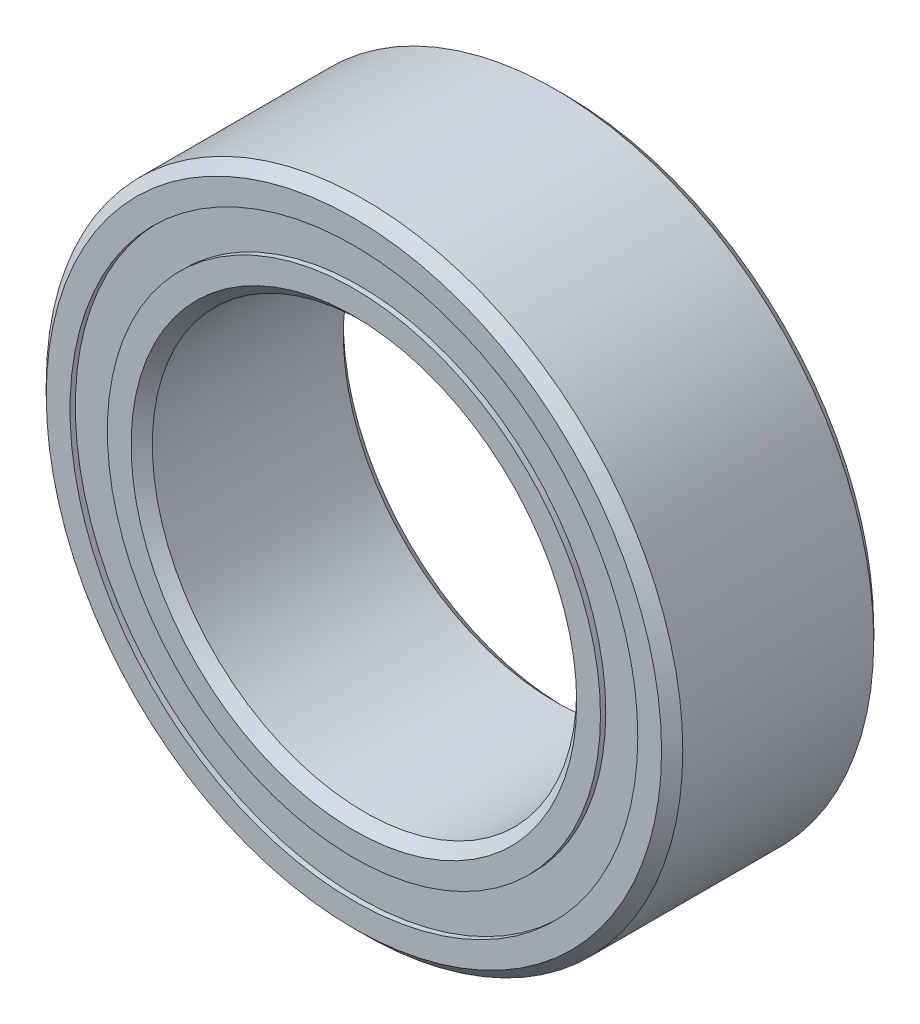
ISO-10303-21;
HEADER;
FILE_DESCRIPTION(('STEP AP214'),'2;1');
FILE_NAME('part.step','',(''),(''),'','','');
FILE_SCHEMA(('AUTOMOTIVE_DESIGN { 1 0 10303 214 1 1 1 1 }'));
ENDSEC;
DATA;
#1=APPLICATION_CONTEXT('core data for automotive mechanical design processes');
#2=APPLICATION_PROTOCOL_DEFINITION('international standard','automotive_design',2000,#1);
#3=PRODUCT_CONTEXT('',#1,'mechanical');
#4=PRODUCT('Part','Part','',(#3));
#5=PRODUCT_RELATED_PRODUCT_CATEGORY('part','',(#4));
#6=PRODUCT_DEFINITION_FORMATION('','',#4);
#7=PRODUCT_DEFINITION_CONTEXT('part definition',#1,'design');
#8=PRODUCT_DEFINITION('design','',#6,#7);
#9=PRODUCT_DEFINITION_SHAPE('','',#8);
#10=(LENGTH_UNIT() NAMED_UNIT(*) SI_UNIT(.MILLI.,.METRE.));
#11=(NAMED_UNIT(*) PLANE_ANGLE_UNIT() SI_UNIT($,.RADIAN.));
#12=(NAMED_UNIT(*) SI_UNIT($,.STERADIAN.) SOLID_ANGLE_UNIT());
#13=UNCERTAINTY_MEASURE_WITH_UNIT(LENGTH_MEASURE(1.E-05),#10,'distance_accuracy_value','');
#14=(GEOMETRIC_REPRESENTATION_CONTEXT(3) GLOBAL_UNCERTAINTY_ASSIGNED_CONTEXT((#13)) GLOBAL_UNIT_ASSIGNED_CONTEXT((#10,
#11,#12)) REPRESENTATION_CONTEXT('',''));
#15=CARTESIAN_POINT('',(0.,0.,0.));
#16=DIRECTION('',(0.,0.,1.));
#17=DIRECTION('',(1.,0.,0.));
#18=AXIS2_PLACEMENT_3D('',#15,#16,#17);
#19=CARTESIAN_POINT('',(0.,4.24787087912088,-1.508125));
#20=DIRECTION('',(0.,0.,1.));
#21=DIRECTION('',(1.,0.,0.));
#22=AXIS2_PLACEMENT_3D('',#19,#20,#21);
#23=PLANE('',#22);
#24=CARTESIAN_POINT('',(0.,0.,-1.508125));
#25=DIRECTION('',(0.,0.,1.));
#26=DIRECTION('',(1.,0.,0.));
#27=AXIS2_PLACEMENT_3D('',#24,#25,#26);
#28=CIRCLE('',#27,4.24787087912088);
#29=CARTESIAN_POINT('',(4.24787087912088,0.,-1.508125));
#30=VERTEX_POINT('',#29);
#31=EDGE_CURVE('E55',#30,#30,#28,.T.);
#32=ORIENTED_EDGE('',*,*,#31,.F.);
#33=EDGE_LOOP('',(#32));
#34=FACE_BOUND('',#33,.T.);
#35=CARTESIAN_POINT('',(0.,0.,-1.508125));
#36=DIRECTION('',(0.,0.,1.));
#37=DIRECTION('',(1.,0.,0.));
#38=AXIS2_PLACEMENT_3D('',#35,#36,#37);
#39=CIRCLE('',#38,3.68962912087912);
#40=CARTESIAN_POINT('',(3.68962912087912,0.,-1.508125));
#41=VERTEX_POINT('',#40);
#42=EDGE_CURVE('E11',#41,#41,#39,.T.);
#43=ORIENTED_EDGE('',*,*,#42,.T.);
#44=EDGE_LOOP('',(#43));
#45=FACE_BOUND('',#44,.T.);
#46=ADVANCED_FACE('F41',(#34,#45),#23,.F.);
#47=CARTESIAN_POINT('',(0.,0.,1.5875));
#48=DIRECTION('',(0.,0.,1.));
#49=DIRECTION('',(1.,0.,0.));
#50=AXIS2_PLACEMENT_3D('',#47,#48,#49);
#51=CYLINDRICAL_SURFACE('',#50,3.68962912087912);
#52=ORIENTED_EDGE('',*,*,#42,.F.);
#53=EDGE_LOOP('',(#52));
#54=FACE_BOUND('',#53,.T.);
#55=CARTESIAN_POINT('',(0.,0.,-0.758760243513405));
#56=DIRECTION('',(0.,0.,1.));
#57=DIRECTION('',(1.,0.,0.));
#58=AXIS2_PLACEMENT_3D('',#55,#56,#57);
#59=CIRCLE('',#58,3.68962912087912);
#60=CARTESIAN_POINT('',(3.68962912087912,0.,-0.758760243513405));
#61=VERTEX_POINT('',#60);
#62=EDGE_CURVE('E47',#61,#61,#59,.T.);
#63=ORIENTED_EDGE('',*,*,#62,.T.);
#64=EDGE_LOOP('',(#63));
#65=FACE_BOUND('',#64,.T.);
#66=ADVANCED_FACE('F64',(#54,#65),#51,.F.);
#67=CARTESIAN_POINT('',(0.,4.24787087912088,-0.758760243513405));
#68=DIRECTION('',(0.,0.,-1.));
#69=DIRECTION('',(-1.,0.,0.));
#70=AXIS2_PLACEMENT_3D('',#67,#68,#69);
#71=PLANE('',#70);
#72=ORIENTED_EDGE('',*,*,#62,.F.);
#73=EDGE_LOOP('',(#72));
#74=FACE_BOUND('',#73,.T.);
#75=CARTESIAN_POINT('',(0.,0.,-0.758760243513405));
#76=DIRECTION('',(0.,0.,1.));
#77=DIRECTION('',(1.,0.,0.));
#78=AXIS2_PLACEMENT_3D('',#75,#76,#77);
#79=CIRCLE('',#78,4.24787087912088);
#80=CARTESIAN_POINT('',(4.24787087912088,0.,-0.758760243513405));
#81=VERTEX_POINT('',#80);
#82=EDGE_CURVE('E51',#81,#81,#79,.T.);
#83=ORIENTED_EDGE('',*,*,#82,.T.);
#84=EDGE_LOOP('',(#83));
#85=FACE_BOUND('',#84,.T.);
#86=ADVANCED_FACE('F68',(#74,#85),#71,.F.);
#87=CARTESIAN_POINT('',(0.,0.,1.5875));
#88=DIRECTION('',(0.,0.,1.));
#89=DIRECTION('',(1.,0.,0.));
#90=AXIS2_PLACEMENT_3D('',#87,#88,#89);
#91=CYLINDRICAL_SURFACE('',#90,4.24787087912088);
#92=ORIENTED_EDGE('',*,*,#82,.F.);
#93=EDGE_LOOP('',(#92));
#94=FACE_BOUND('',#93,.T.);
#95=ORIENTED_EDGE('',*,*,#31,.T.);
#96=EDGE_LOOP('',(#95));
#97=FACE_BOUND('',#96,.T.);
#98=ADVANCED_FACE('F61',(#94,#97),#91,.T.);
#99=CLOSED_SHELL('',(#46,#66,#86,#98));
#100=MANIFOLD_SOLID_BREP('B2',#99);
#101=CARTESIAN_POINT('',(0.,4.24787087912088,1.508125));
#102=DIRECTION('',(0.,0.,-1.));
#103=DIRECTION('',(-1.,0.,0.));
#104=AXIS2_PLACEMENT_3D('',#101,#102,#103);
#105=PLANE('',#104);
#106=CARTESIAN_POINT('',(0.,0.,1.508125));
#107=DIRECTION('',(0.,0.,1.));
#108=DIRECTION('',(1.,0.,0.));
#109=AXIS2_PLACEMENT_3D('',#106,#107,#108);
#110=CIRCLE('',#109,3.68962912087912);
#111=CARTESIAN_POINT('',(3.68962912087912,0.,1.508125));
#112=VERTEX_POINT('',#111);
#113=EDGE_CURVE('E40',#112,#112,#110,.T.);
#114=ORIENTED_EDGE('',*,*,#113,.F.);
#115=EDGE_LOOP('',(#114));
#116=FACE_BOUND('',#115,.T.);
#117=CARTESIAN_POINT('',(0.,0.,1.508125));
#118=DIRECTION('',(0.,0.,1.));
#119=DIRECTION('',(1.,0.,0.));
#120=AXIS2_PLACEMENT_3D('',#117,#118,#119);
#121=CIRCLE('',#120,4.24787087912088);
#122=CARTESIAN_POINT('',(4.24787087912088,0.,1.508125));
#123=VERTEX_POINT('',#122);
#124=EDGE_CURVE('E122',#123,#123,#121,.T.);
#125=ORIENTED_EDGE('',*,*,#124,.T.);
#126=EDGE_LOOP('',(#125));
#127=FACE_BOUND('',#126,.T.);
#128=ADVANCED_FACE('F108',(#116,#127),#105,.F.);
#129=CARTESIAN_POINT('',(0.,0.,1.5875));
#130=DIRECTION('',(0.,0.,1.));
#131=DIRECTION('',(1.,0.,0.));
#132=AXIS2_PLACEMENT_3D('',#129,#130,#131);
#133=CYLINDRICAL_SURFACE('',#132,3.68962912087912);
#134=CARTESIAN_POINT('',(0.,0.,0.758760243513404));
#135=DIRECTION('',(0.,0.,1.));
#136=DIRECTION('',(1.,0.,0.));
#137=AXIS2_PLACEMENT_3D('',#134,#135,#136);
#138=CIRCLE('',#137,3.68962912087912);
#139=CARTESIAN_POINT('',(3.68962912087912,0.,0.758760243513404));
#140=VERTEX_POINT('',#139);
#141=EDGE_CURVE('E114',#140,#140,#138,.T.);
#142=ORIENTED_EDGE('',*,*,#141,.F.);
#143=EDGE_LOOP('',(#142));
#144=FACE_BOUND('',#143,.T.);
#145=ORIENTED_EDGE('',*,*,#113,.T.);
#146=EDGE_LOOP('',(#145));
#147=FACE_BOUND('',#146,.T.);
#148=ADVANCED_FACE('F137',(#144,#147),#133,.F.);
#149=CARTESIAN_POINT('',(0.,4.24787087912088,0.758760243513404));
#150=DIRECTION('',(0.,0.,1.));
#151=DIRECTION('',(1.,0.,0.));
#152=AXIS2_PLACEMENT_3D('',#149,#150,#151);
#153=PLANE('',#152);
#154=CARTESIAN_POINT('',(0.,0.,0.758760243513404));
#155=DIRECTION('',(0.,0.,1.));
#156=DIRECTION('',(1.,0.,0.));
#157=AXIS2_PLACEMENT_3D('',#154,#155,#156);
#158=CIRCLE('',#157,4.24787087912088);
#159=CARTESIAN_POINT('',(4.24787087912088,0.,0.758760243513404));
#160=VERTEX_POINT('',#159);
#161=EDGE_CURVE('E118',#160,#160,#158,.T.);
#162=ORIENTED_EDGE('',*,*,#161,.F.);
#163=EDGE_LOOP('',(#162));
#164=FACE_BOUND('',#163,.T.);
#165=ORIENTED_EDGE('',*,*,#141,.T.);
#166=EDGE_LOOP('',(#165));
#167=FACE_BOUND('',#166,.T.);
#168=ADVANCED_FACE('F132',(#164,#167),#153,.F.);
#169=CARTESIAN_POINT('',(0.,0.,1.5875));
#170=DIRECTION('',(0.,0.,1.));
#171=DIRECTION('',(1.,0.,0.));
#172=AXIS2_PLACEMENT_3D('',#169,#170,#171);
#173=CYLINDRICAL_SURFACE('',#172,4.24787087912088);
#174=ORIENTED_EDGE('',*,*,#124,.F.);
#175=EDGE_LOOP('',(#174));
#176=FACE_BOUND('',#175,.T.);
#177=ORIENTED_EDGE('',*,*,#161,.T.);
#178=EDGE_LOOP('',(#177));
#179=FACE_BOUND('',#178,.T.);
#180=ADVANCED_FACE('F129',(#176,#179),#173,.T.);
#181=CLOSED_SHELL('',(#128,#148,#168,#180));
#182=MANIFOLD_SOLID_BREP('B6',#181);
#183=CARTESIAN_POINT('',(-1.98437499999996,3.43703832126952,0.));
#184=DIRECTION('',(0.,0.,1.));
#185=DIRECTION('',(-0.499999999999989,0.866025403784445,0.));
#186=AXIS2_PLACEMENT_3D('',#183,#184,#185);
#187=SPHERICAL_SURFACE('',#186,0.758760243513404);
#188=CARTESIAN_POINT('',(-1.98437499999996,3.43703832126952,0.758760243513404));
#189=VERTEX_POINT('',#188);
#190=VERTEX_LOOP('',#189);
#191=FACE_BOUND('',#190,.T.);
#192=ADVANCED_FACE('F175',(#191),#187,.T.);
#193=CLOSED_SHELL('',(#192));
#194=MANIFOLD_SOLID_BREP('B35',#193);
#195=CARTESIAN_POINT('',(-3.43703832126947,1.98437500000004,0.));
#196=DIRECTION('',(0.,0.,1.));
#197=DIRECTION('',(-0.866025403784433,0.50000000000001,0.));
#198=AXIS2_PLACEMENT_3D('',#195,#196,#197);
#199=SPHERICAL_SURFACE('',#198,0.758760243513404);
#200=CARTESIAN_POINT('',(-3.43703832126947,1.98437500000004,0.758760243513404));
#201=VERTEX_POINT('',#200);
#202=VERTEX_LOOP('',#201);
#203=FACE_BOUND('',#202,.T.);
#204=ADVANCED_FACE('F195',(#203),#199,.T.);
#205=CLOSED_SHELL('',(#204));
#206=MANIFOLD_SOLID_BREP('B104',#205);
#207=CARTESIAN_POINT('',(-3.96875,0.,0.));
#208=DIRECTION('',(0.,0.,1.));
#209=DIRECTION('',(-1.,0.,0.));
#210=AXIS2_PLACEMENT_3D('',#207,#208,#209);
#211=SPHERICAL_SURFACE('',#210,0.758760243513404);
#212=CARTESIAN_POINT('',(-3.96875,0.,0.758760243513404));
#213=VERTEX_POINT('',#212);
#214=VERTEX_LOOP('',#213);
#215=FACE_BOUND('',#214,.T.);
#216=ADVANCED_FACE('F215',(#215),#211,.T.);
#217=CLOSED_SHELL('',(#216));
#218=MANIFOLD_SOLID_BREP('B171',#217);
#219=CARTESIAN_POINT('',(-3.43703832126951,-1.98437499999997,0.));
#220=DIRECTION('',(0.,0.,1.));
#221=DIRECTION('',(-0.866025403784443,-0.499999999999992,0.));
#222=AXIS2_PLACEMENT_3D('',#219,#220,#221);
#223=SPHERICAL_SURFACE('',#222,0.758760243513404);
#224=CARTESIAN_POINT('',(-3.43703832126951,-1.98437499999997,0.758760243513404));
#225=VERTEX_POINT('',#224);
#226=VERTEX_LOOP('',#225);
#227=FACE_BOUND('',#226,.T.);
#228=ADVANCED_FACE('F235',(#227),#223,.T.);
#229=CLOSED_SHELL('',(#228));
#230=MANIFOLD_SOLID_BREP('B191',#229);
#231=CARTESIAN_POINT('',(-1.98437500000003,-3.43703832126947,0.));
#232=DIRECTION('',(0.,0.,1.));
#233=DIRECTION('',(-0.500000000000007,-0.866025403784435,0.));
#234=AXIS2_PLACEMENT_3D('',#231,#232,#233);
#235=SPHERICAL_SURFACE('',#234,0.758760243513404);
#236=CARTESIAN_POINT('',(-1.98437500000003,-3.43703832126947,0.758760243513404));
#237=VERTEX_POINT('',#236);
#238=VERTEX_LOOP('',#237);
#239=FACE_BOUND('',#238,.T.);
#240=ADVANCED_FACE('F255',(#239),#235,.T.);
#241=CLOSED_SHELL('',(#240));
#242=MANIFOLD_SOLID_BREP('B211',#241);
#243=CARTESIAN_POINT('',(0.,-3.96875,0.));
#244=DIRECTION('',(0.,0.,1.));
#245=DIRECTION('',(0.,-1.,0.));
#246=AXIS2_PLACEMENT_3D('',#243,#244,#245);
#247=SPHERICAL_SURFACE('',#246,0.758760243513404);
#248=CARTESIAN_POINT('',(0.,-3.96875,0.758760243513404));
#249=VERTEX_POINT('',#248);
#250=VERTEX_LOOP('',#249);
#251=FACE_BOUND('',#250,.T.);
#252=ADVANCED_FACE('F275',(#251),#247,.T.);
#253=CLOSED_SHELL('',(#252));
#254=MANIFOLD_SOLID_BREP('B231',#253);
#255=CARTESIAN_POINT('',(1.98437499999998,-3.4370383212695,0.));
#256=DIRECTION('',(0.,0.,1.));
#257=DIRECTION('',(0.499999999999995,-0.866025403784442,0.));
#258=AXIS2_PLACEMENT_3D('',#255,#256,#257);
#259=SPHERICAL_SURFACE('',#258,0.758760243513404);
#260=CARTESIAN_POINT('',(1.98437499999998,-3.4370383212695,0.758760243513404));
#261=VERTEX_POINT('',#260);
#262=VERTEX_LOOP('',#261);
#263=FACE_BOUND('',#262,.T.);
#264=ADVANCED_FACE('F295',(#263),#259,.T.);
#265=CLOSED_SHELL('',(#264));
#266=MANIFOLD_SOLID_BREP('B251',#265);
#267=CARTESIAN_POINT('',(3.43703832126948,-1.98437500000002,0.));
#268=DIRECTION('',(0.,0.,1.));
#269=DIRECTION('',(0.866025403784436,-0.500000000000004,0.));
#270=AXIS2_PLACEMENT_3D('',#267,#268,#269);
#271=SPHERICAL_SURFACE('',#270,0.758760243513404);
#272=CARTESIAN_POINT('',(3.43703832126948,-1.98437500000002,0.758760243513404));
#273=VERTEX_POINT('',#272);
#274=VERTEX_LOOP('',#273);
#275=FACE_BOUND('',#274,.T.);
#276=ADVANCED_FACE('F315',(#275),#271,.T.);
#277=CLOSED_SHELL('',(#276));
#278=MANIFOLD_SOLID_BREP('B271',#277);
#279=CARTESIAN_POINT('',(3.96875,0.,0.));
#280=DIRECTION('',(0.,0.,1.));
#281=DIRECTION('',(1.,0.,0.));
#282=AXIS2_PLACEMENT_3D('',#279,#280,#281);
#283=SPHERICAL_SURFACE('',#282,0.758760243513404);
#284=CARTESIAN_POINT('',(3.96875,0.,0.758760243513404));
#285=VERTEX_POINT('',#284);
#286=VERTEX_LOOP('',#285);
#287=FACE_BOUND('',#286,.T.);
#288=ADVANCED_FACE('F335',(#287),#283,.T.);
#289=CLOSED_SHELL('',(#288));
#290=MANIFOLD_SOLID_BREP('B291',#289);
#291=CARTESIAN_POINT('',(3.4370383212695,1.98437499999999,0.));
#292=DIRECTION('',(0.,0.,1.));
#293=DIRECTION('',(0.86602540378444,0.499999999999998,0.));
#294=AXIS2_PLACEMENT_3D('',#291,#292,#293);
#295=SPHERICAL_SURFACE('',#294,0.758760243513404);
#296=CARTESIAN_POINT('',(3.4370383212695,1.98437499999999,0.758760243513404));
#297=VERTEX_POINT('',#296);
#298=VERTEX_LOOP('',#297);
#299=FACE_BOUND('',#298,.T.);
#300=ADVANCED_FACE('F355',(#299),#295,.T.);
#301=CLOSED_SHELL('',(#300));
#302=MANIFOLD_SOLID_BREP('B311',#301);
#303=CARTESIAN_POINT('',(1.984375,3.43703832126949,0.));
#304=DIRECTION('',(0.,0.,1.));
#305=DIRECTION('',(0.500000000000001,0.866025403784438,0.));
#306=AXIS2_PLACEMENT_3D('',#303,#304,#305);
#307=SPHERICAL_SURFACE('',#306,0.758760243513404);
#308=CARTESIAN_POINT('',(1.984375,3.43703832126949,0.758760243513404));
#309=VERTEX_POINT('',#308);
#310=VERTEX_LOOP('',#309);
#311=FACE_BOUND('',#310,.T.);
#312=ADVANCED_FACE('F375',(#311),#307,.T.);
#313=CLOSED_SHELL('',(#312));
#314=MANIFOLD_SOLID_BREP('B331',#313);
#315=CARTESIAN_POINT('',(0.,3.96875,0.));
#316=DIRECTION('',(0.,0.,1.));
#317=DIRECTION('',(0.,1.,0.));
#318=AXIS2_PLACEMENT_3D('',#315,#316,#317);
#319=SPHERICAL_SURFACE('',#318,0.758760243513404);
#320=CARTESIAN_POINT('',(0.,3.96875,0.758760243513404));
#321=VERTEX_POINT('',#320);
#322=VERTEX_LOOP('',#321);
#323=FACE_BOUND('',#322,.T.);
#324=ADVANCED_FACE('F397',(#323),#319,.T.);
#325=CLOSED_SHELL('',(#324));
#326=MANIFOLD_SOLID_BREP('B351',#325);
#327=CARTESIAN_POINT('',(0.,3.68962912087912,1.5875));
#328=DIRECTION('',(0.,0.,-1.));
#329=DIRECTION('',(-1.,0.,0.));
#330=AXIS2_PLACEMENT_3D('',#327,#328,#329);
#331=PLANE('',#330);
#332=CARTESIAN_POINT('',(0.,0.,1.5875));
#333=DIRECTION('',(0.,0.,1.));
#334=DIRECTION('',(1.,0.,0.));
#335=AXIS2_PLACEMENT_3D('',#332,#333,#334);
#336=CIRCLE('',#335,3.33375);
#337=CARTESIAN_POINT('',(3.33375,0.,1.5875));
#338=VERTEX_POINT('',#337);
#339=EDGE_CURVE('E444',#338,#338,#336,.T.);
#340=ORIENTED_EDGE('',*,*,#339,.F.);
#341=EDGE_LOOP('',(#340));
#342=FACE_BOUND('',#341,.T.);
#343=CARTESIAN_POINT('',(0.,0.,1.5875));
#344=DIRECTION('',(0.,0.,1.));
#345=DIRECTION('',(1.,0.,0.));
#346=AXIS2_PLACEMENT_3D('',#343,#344,#345);
#347=CIRCLE('',#346,3.68962912087912);
#348=CARTESIAN_POINT('',(3.68962912087912,0.,1.5875));
#349=VERTEX_POINT('',#348);
#350=EDGE_CURVE('E396',#349,#349,#347,.T.);
#351=ORIENTED_EDGE('',*,*,#350,.T.);
#352=EDGE_LOOP('',(#351));
#353=FACE_BOUND('',#352,.T.);
#354=ADVANCED_FACE('F416',(#342,#353),#331,.F.);
#355=CARTESIAN_POINT('',(0.,0.,1.5875));
#356=DIRECTION('',(0.,0.,1.));
#357=DIRECTION('',(1.,0.,0.));
#358=AXIS2_PLACEMENT_3D('',#355,#356,#357);
#359=CYLINDRICAL_SURFACE('',#358,3.68962912087912);
#360=ORIENTED_EDGE('',*,*,#350,.F.);
#361=EDGE_LOOP('',(#360));
#362=FACE_BOUND('',#361,.T.);
#363=CARTESIAN_POINT('',(0.,0.,0.705555555555556));
#364=DIRECTION('',(0.,0.,1.));
#365=DIRECTION('',(1.,0.,0.));
#366=AXIS2_PLACEMENT_3D('',#363,#364,#365);
#367=CIRCLE('',#366,3.68962912087912);
#368=CARTESIAN_POINT('',(3.68962912087912,0.,0.705555555555556));
#369=VERTEX_POINT('',#368);
#370=EDGE_CURVE('E422',#369,#369,#367,.T.);
#371=ORIENTED_EDGE('',*,*,#370,.T.);
#372=EDGE_LOOP('',(#371));
#373=FACE_BOUND('',#372,.T.);
#374=ADVANCED_FACE('F451',(#362,#373),#359,.T.);
#375=CARTESIAN_POINT('',(0.,0.,0.));
#376=DIRECTION('',(0.,0.,1.));
#377=DIRECTION('',(1.,0.,0.));
#378=AXIS2_PLACEMENT_3D('',#375,#376,#377);
#379=TOROIDAL_SURFACE('',#378,3.96875,0.758760243513403);
#380=ORIENTED_EDGE('',*,*,#370,.F.);
#381=EDGE_LOOP('',(#380));
#382=FACE_BOUND('',#381,.T.);
#383=CARTESIAN_POINT('',(0.,0.,-0.705555555555557));
#384=DIRECTION('',(0.,0.,1.));
#385=DIRECTION('',(1.,0.,0.));
#386=AXIS2_PLACEMENT_3D('',#383,#384,#385);
#387=CIRCLE('',#386,3.68962912087912);
#388=CARTESIAN_POINT('',(3.68962912087912,0.,-0.705555555555557));
#389=VERTEX_POINT('',#388);
#390=EDGE_CURVE('E426',#389,#389,#387,.T.);
#391=ORIENTED_EDGE('',*,*,#390,.T.);
#392=EDGE_LOOP('',(#391));
#393=FACE_BOUND('',#392,.T.);
#394=ADVANCED_FACE('F455',(#382,#393),#379,.F.);
#395=CARTESIAN_POINT('',(0.,0.,1.5875));
#396=DIRECTION('',(0.,0.,1.));
#397=DIRECTION('',(1.,0.,0.));
#398=AXIS2_PLACEMENT_3D('',#395,#396,#397);
#399=CYLINDRICAL_SURFACE('',#398,3.68962912087912);
#400=ORIENTED_EDGE('',*,*,#390,.F.);
#401=EDGE_LOOP('',(#400));
#402=FACE_BOUND('',#401,.T.);
#403=CARTESIAN_POINT('',(0.,0.,-1.5875));
#404=DIRECTION('',(0.,0.,1.));
#405=DIRECTION('',(1.,0.,0.));
#406=AXIS2_PLACEMENT_3D('',#403,#404,#405);
#407=CIRCLE('',#406,3.68962912087912);
#408=CARTESIAN_POINT('',(3.68962912087912,0.,-1.5875));
#409=VERTEX_POINT('',#408);
#410=EDGE_CURVE('E430',#409,#409,#407,.T.);
#411=ORIENTED_EDGE('',*,*,#410,.T.);
#412=EDGE_LOOP('',(#411));
#413=FACE_BOUND('',#412,.T.);
#414=ADVANCED_FACE('F460',(#402,#413),#399,.T.);
#415=CARTESIAN_POINT('',(0.,3.33375,-1.5875));
#416=DIRECTION('',(0.,0.,1.));
#417=DIRECTION('',(1.,0.,0.));
#418=AXIS2_PLACEMENT_3D('',#415,#416,#417);
#419=PLANE('',#418);
#420=ORIENTED_EDGE('',*,*,#410,.F.);
#421=EDGE_LOOP('',(#420));
#422=FACE_BOUND('',#421,.T.);
#423=CARTESIAN_POINT('',(0.,0.,-1.5875));
#424=DIRECTION('',(0.,0.,1.));
#425=DIRECTION('',(1.,0.,0.));
#426=AXIS2_PLACEMENT_3D('',#423,#424,#425);
#427=CIRCLE('',#426,3.33375);
#428=CARTESIAN_POINT('',(3.33375,0.,-1.5875));
#429=VERTEX_POINT('',#428);
#430=EDGE_CURVE('E435',#429,#429,#427,.T.);
#431=ORIENTED_EDGE('',*,*,#430,.T.);
#432=EDGE_LOOP('',(#431));
#433=FACE_BOUND('',#432,.T.);
#434=ADVANCED_FACE('F466',(#422,#433),#419,.F.);
#435=CARTESIAN_POINT('',(0.,0.,-1.42875));
#436=DIRECTION('',(0.,0.,-1.));
#437=DIRECTION('',(-1.,0.,0.));
#438=AXIS2_PLACEMENT_3D('',#435,#436,#437);
#439=CONICAL_SURFACE('',#438,3.175,0.785398163397451);
#440=ORIENTED_EDGE('',*,*,#430,.F.);
#441=EDGE_LOOP('',(#440));
#442=FACE_BOUND('',#441,.T.);
#443=CARTESIAN_POINT('',(0.,0.,-1.42875));
#444=DIRECTION('',(0.,0.,1.));
#445=DIRECTION('',(1.,0.,0.));
#446=AXIS2_PLACEMENT_3D('',#443,#444,#445);
#447=CIRCLE('',#446,3.175);
#448=CARTESIAN_POINT('',(3.175,0.,-1.42875));
#449=VERTEX_POINT('',#448);
#450=EDGE_CURVE('E438',#449,#449,#447,.T.);
#451=ORIENTED_EDGE('',*,*,#450,.T.);
#452=EDGE_LOOP('',(#451));
#453=FACE_BOUND('',#452,.T.);
#454=ADVANCED_FACE('F470',(#442,#453),#439,.F.);
#455=CARTESIAN_POINT('',(0.,0.,1.5875));
#456=DIRECTION('',(0.,0.,1.));
#457=DIRECTION('',(1.,0.,0.));
#458=AXIS2_PLACEMENT_3D('',#455,#456,#457);
#459=CYLINDRICAL_SURFACE('',#458,3.175);
#460=ORIENTED_EDGE('',*,*,#450,.F.);
#461=EDGE_LOOP('',(#460));
#462=FACE_BOUND('',#461,.T.);
#463=CARTESIAN_POINT('',(0.,0.,1.42875));
#464=DIRECTION('',(0.,0.,1.));
#465=DIRECTION('',(1.,0.,0.));
#466=AXIS2_PLACEMENT_3D('',#463,#464,#465);
#467=CIRCLE('',#466,3.175);
#468=CARTESIAN_POINT('',(3.175,0.,1.42875));
#469=VERTEX_POINT('',#468);
#470=EDGE_CURVE('E441',#469,#469,#467,.T.);
#471=ORIENTED_EDGE('',*,*,#470,.T.);
#472=EDGE_LOOP('',(#471));
#473=FACE_BOUND('',#472,.T.);
#474=ADVANCED_FACE('F474',(#462,#473),#459,.F.);
#475=CARTESIAN_POINT('',(0.,0.,1.5875));
#476=DIRECTION('',(0.,0.,1.));
#477=DIRECTION('',(1.,0.,0.));
#478=AXIS2_PLACEMENT_3D('',#475,#476,#477);
#479=CONICAL_SURFACE('',#478,3.33375,0.785398163397448);
#480=ORIENTED_EDGE('',*,*,#470,.F.);
#481=EDGE_LOOP('',(#480));
#482=FACE_BOUND('',#481,.T.);
#483=ORIENTED_EDGE('',*,*,#339,.T.);
#484=EDGE_LOOP('',(#483));
#485=FACE_BOUND('',#484,.T.);
#486=ADVANCED_FACE('F448',(#482,#485),#479,.F.);
#487=CLOSED_SHELL('',(#354,#374,#394,#414,#434,#454,#474,#486));
#488=MANIFOLD_SOLID_BREP('B371',#487);
#489=CARTESIAN_POINT('',(0.,0.,1.42875));
#490=DIRECTION('',(0.,0.,-1.));
#491=DIRECTION('',(-1.,0.,0.));
#492=AXIS2_PLACEMENT_3D('',#489,#490,#491);
#493=CONICAL_SURFACE('',#492,4.7625,0.785398163397446);
#494=CARTESIAN_POINT('',(0.,0.,1.5875));
#495=DIRECTION('',(0.,0.,1.));
#496=DIRECTION('',(1.,0.,0.));
#497=AXIS2_PLACEMENT_3D('',#494,#495,#496);
#498=CIRCLE('',#497,4.60375);
#499=CARTESIAN_POINT('',(4.60375,0.,1.5875));
#500=VERTEX_POINT('',#499);
#501=EDGE_CURVE('E565',#500,#500,#498,.T.);
#502=ORIENTED_EDGE('',*,*,#501,.F.);
#503=EDGE_LOOP('',(#502));
#504=FACE_BOUND('',#503,.T.);
#505=CARTESIAN_POINT('',(0.,0.,1.42875));
#506=DIRECTION('',(0.,0.,1.));
#507=DIRECTION('',(1.,0.,0.));
#508=AXIS2_PLACEMENT_3D('',#505,#506,#507);
#509=CIRCLE('',#508,4.7625);
#510=CARTESIAN_POINT('',(4.7625,0.,1.42875));
#511=VERTEX_POINT('',#510);
#512=EDGE_CURVE('E415',#511,#511,#509,.T.);
#513=ORIENTED_EDGE('',*,*,#512,.T.);
#514=EDGE_LOOP('',(#513));
#515=FACE_BOUND('',#514,.T.);
#516=ADVANCED_FACE('F537',(#504,#515),#493,.T.);
#517=CARTESIAN_POINT('',(0.,0.,1.5875));
#518=DIRECTION('',(0.,0.,1.));
#519=DIRECTION('',(1.,0.,0.));
#520=AXIS2_PLACEMENT_3D('',#517,#518,#519);
#521=CYLINDRICAL_SURFACE('',#520,4.7625);
#522=ORIENTED_EDGE('',*,*,#512,.F.);
#523=EDGE_LOOP('',(#522));
#524=FACE_BOUND('',#523,.T.);
#525=CARTESIAN_POINT('',(0.,0.,-1.42875));
#526=DIRECTION('',(0.,0.,1.));
#527=DIRECTION('',(1.,0.,0.));
#528=AXIS2_PLACEMENT_3D('',#525,#526,#527);
#529=CIRCLE('',#528,4.7625);
#530=CARTESIAN_POINT('',(4.7625,0.,-1.42875));
#531=VERTEX_POINT('',#530);
#532=EDGE_CURVE('E543',#531,#531,#529,.T.);
#533=ORIENTED_EDGE('',*,*,#532,.T.);
#534=EDGE_LOOP('',(#533));
#535=FACE_BOUND('',#534,.T.);
#536=ADVANCED_FACE('F572',(#524,#535),#521,.T.);
#537=CARTESIAN_POINT('',(0.,0.,-1.5875));
#538=DIRECTION('',(0.,0.,1.));
#539=DIRECTION('',(1.,0.,0.));
#540=AXIS2_PLACEMENT_3D('',#537,#538,#539);
#541=CONICAL_SURFACE('',#540,4.60375,0.785398163397446);
#542=ORIENTED_EDGE('',*,*,#532,.F.);
#543=EDGE_LOOP('',(#542));
#544=FACE_BOUND('',#543,.T.);
#545=CARTESIAN_POINT('',(0.,0.,-1.5875));
#546=DIRECTION('',(0.,0.,1.));
#547=DIRECTION('',(1.,0.,0.));
#548=AXIS2_PLACEMENT_3D('',#545,#546,#547);
#549=CIRCLE('',#548,4.60375);
#550=CARTESIAN_POINT('',(4.60375,0.,-1.5875));
#551=VERTEX_POINT('',#550);
#552=EDGE_CURVE('E547',#551,#551,#549,.T.);
#553=ORIENTED_EDGE('',*,*,#552,.T.);
#554=EDGE_LOOP('',(#553));
#555=FACE_BOUND('',#554,.T.);
#556=ADVANCED_FACE('F576',(#544,#555),#541,.T.);
#557=CARTESIAN_POINT('',(0.,4.60375,-1.5875));
#558=DIRECTION('',(0.,0.,1.));
#559=DIRECTION('',(1.,0.,0.));
#560=AXIS2_PLACEMENT_3D('',#557,#558,#559);
#561=PLANE('',#560);
#562=ORIENTED_EDGE('',*,*,#552,.F.);
#563=EDGE_LOOP('',(#562));
#564=FACE_BOUND('',#563,.T.);
#565=CARTESIAN_POINT('',(0.,0.,-1.5875));
#566=DIRECTION('',(0.,0.,1.));
#567=DIRECTION('',(1.,0.,0.));
#568=AXIS2_PLACEMENT_3D('',#565,#566,#567);
#569=CIRCLE('',#568,4.24787087912088);
#570=CARTESIAN_POINT('',(4.24787087912088,0.,-1.5875));
#571=VERTEX_POINT('',#570);
#572=EDGE_CURVE('E551',#571,#571,#569,.T.);
#573=ORIENTED_EDGE('',*,*,#572,.T.);
#574=EDGE_LOOP('',(#573));
#575=FACE_BOUND('',#574,.T.);
#576=ADVANCED_FACE('F581',(#564,#575),#561,.F.);
#577=CARTESIAN_POINT('',(0.,0.,1.5875));
#578=DIRECTION('',(0.,0.,1.));
#579=DIRECTION('',(1.,0.,0.));
#580=AXIS2_PLACEMENT_3D('',#577,#578,#579);
#581=CYLINDRICAL_SURFACE('',#580,4.24787087912088);
#582=ORIENTED_EDGE('',*,*,#572,.F.);
#583=EDGE_LOOP('',(#582));
#584=FACE_BOUND('',#583,.T.);
#585=CARTESIAN_POINT('',(0.,0.,-0.705555555555556));
#586=DIRECTION('',(0.,0.,1.));
#587=DIRECTION('',(1.,0.,0.));
#588=AXIS2_PLACEMENT_3D('',#585,#586,#587);
#589=CIRCLE('',#588,4.24787087912088);
#590=CARTESIAN_POINT('',(4.24787087912088,0.,-0.705555555555556));
#591=VERTEX_POINT('',#590);
#592=EDGE_CURVE('E556',#591,#591,#589,.T.);
#593=ORIENTED_EDGE('',*,*,#592,.T.);
#594=EDGE_LOOP('',(#593));
#595=FACE_BOUND('',#594,.T.);
#596=ADVANCED_FACE('F587',(#584,#595),#581,.F.);
#597=CARTESIAN_POINT('',(0.,0.,0.));
#598=DIRECTION('',(0.,0.,1.));
#599=DIRECTION('',(1.,0.,0.));
#600=AXIS2_PLACEMENT_3D('',#597,#598,#599);
#601=TOROIDAL_SURFACE('',#600,3.96875,0.758760243513404);
#602=ORIENTED_EDGE('',*,*,#592,.F.);
#603=EDGE_LOOP('',(#602));
#604=FACE_BOUND('',#603,.T.);
#605=CARTESIAN_POINT('',(0.,0.,0.705555555555555));
#606=DIRECTION('',(0.,0.,1.));
#607=DIRECTION('',(1.,0.,0.));
#608=AXIS2_PLACEMENT_3D('',#605,#606,#607);
#609=CIRCLE('',#608,4.24787087912088);
#610=CARTESIAN_POINT('',(4.24787087912088,0.,0.705555555555555));
#611=VERTEX_POINT('',#610);
#612=EDGE_CURVE('E559',#611,#611,#609,.T.);
#613=ORIENTED_EDGE('',*,*,#612,.T.);
#614=EDGE_LOOP('',(#613));
#615=FACE_BOUND('',#614,.T.);
#616=ADVANCED_FACE('F591',(#604,#615),#601,.F.);
#617=CARTESIAN_POINT('',(0.,0.,1.5875));
#618=DIRECTION('',(0.,0.,1.));
#619=DIRECTION('',(1.,0.,0.));
#620=AXIS2_PLACEMENT_3D('',#617,#618,#619);
#621=CYLINDRICAL_SURFACE('',#620,4.24787087912088);
#622=ORIENTED_EDGE('',*,*,#612,.F.);
#623=EDGE_LOOP('',(#622));
#624=FACE_BOUND('',#623,.T.);
#625=CARTESIAN_POINT('',(0.,0.,1.5875));
#626=DIRECTION('',(0.,0.,1.));
#627=DIRECTION('',(1.,0.,0.));
#628=AXIS2_PLACEMENT_3D('',#625,#626,#627);
#629=CIRCLE('',#628,4.24787087912088);
#630=CARTESIAN_POINT('',(4.24787087912088,0.,1.5875));
#631=VERTEX_POINT('',#630);
#632=EDGE_CURVE('E562',#631,#631,#629,.T.);
#633=ORIENTED_EDGE('',*,*,#632,.T.);
#634=EDGE_LOOP('',(#633));
#635=FACE_BOUND('',#634,.T.);
#636=ADVANCED_FACE('F595',(#624,#635),#621,.F.);
#637=CARTESIAN_POINT('',(0.,4.60375,1.5875));
#638=DIRECTION('',(0.,0.,-1.));
#639=DIRECTION('',(-1.,0.,0.));
#640=AXIS2_PLACEMENT_3D('',#637,#638,#639);
#641=PLANE('',#640);
#642=ORIENTED_EDGE('',*,*,#632,.F.);
#643=EDGE_LOOP('',(#642));
#644=FACE_BOUND('',#643,.T.);
#645=ORIENTED_EDGE('',*,*,#501,.T.);
#646=EDGE_LOOP('',(#645));
#647=FACE_BOUND('',#646,.T.);
#648=ADVANCED_FACE('F569',(#644,#647),#641,.F.);
#649=CLOSED_SHELL('',(#516,#536,#556,#576,#596,#616,#636,#648));
#650=MANIFOLD_SOLID_BREP('B391',#649);
#651=ADVANCED_BREP_SHAPE_REPRESENTATION('',(#18,#100,#182,#194,#206,#218,#230,#242,#254,#266,
#278,#290,#302,#314,#326,#488,#650),#14);
#652=SHAPE_DEFINITION_REPRESENTATION(#9,#651);
ENDSEC;
END-ISO-10303-21;
